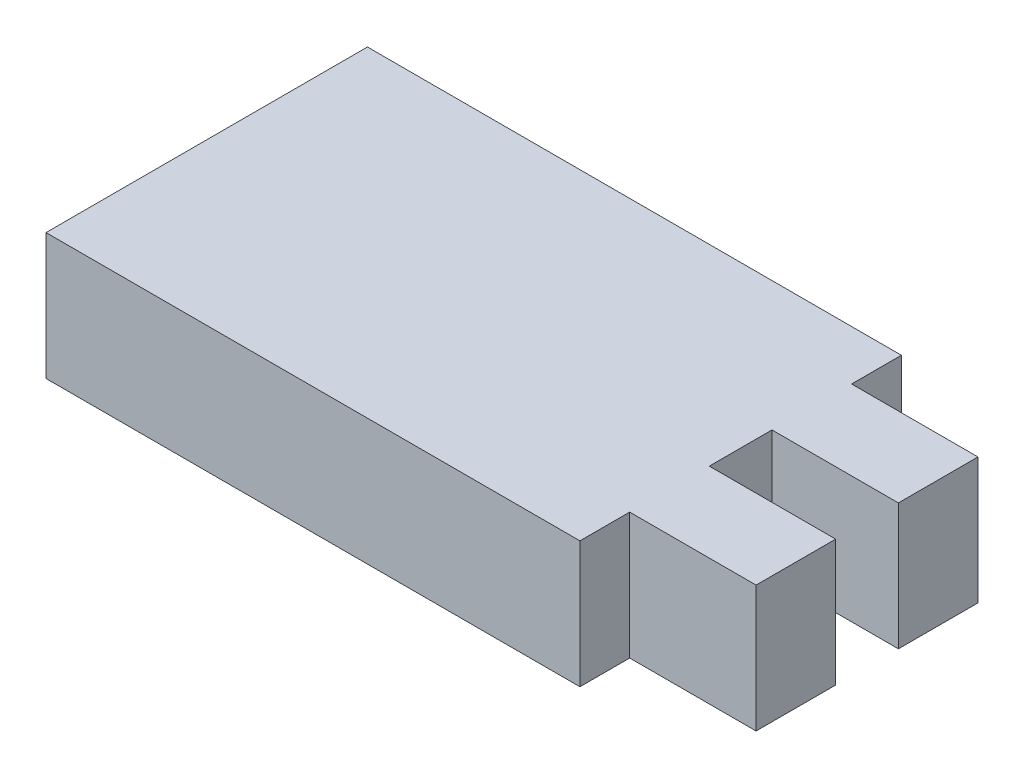
ISO-10303-21;
HEADER;
FILE_DESCRIPTION(('STEP AP214'),'2;1');
FILE_NAME('part.step','',(''),(''),'','','');
FILE_SCHEMA(('AUTOMOTIVE_DESIGN { 1 0 10303 214 1 1 1 1 }'));
ENDSEC;
DATA;
#1=APPLICATION_CONTEXT('core data for automotive mechanical design processes');
#2=APPLICATION_PROTOCOL_DEFINITION('international standard','automotive_design',2000,#1);
#3=PRODUCT_CONTEXT('',#1,'mechanical');
#4=PRODUCT('Part','Part','',(#3));
#5=PRODUCT_RELATED_PRODUCT_CATEGORY('part','',(#4));
#6=PRODUCT_DEFINITION_FORMATION('','',#4);
#7=PRODUCT_DEFINITION_CONTEXT('part definition',#1,'design');
#8=PRODUCT_DEFINITION('design','',#6,#7);
#9=PRODUCT_DEFINITION_SHAPE('','',#8);
#10=(LENGTH_UNIT() NAMED_UNIT(*) SI_UNIT(.MILLI.,.METRE.));
#11=(NAMED_UNIT(*) PLANE_ANGLE_UNIT() SI_UNIT($,.RADIAN.));
#12=(NAMED_UNIT(*) SI_UNIT($,.STERADIAN.) SOLID_ANGLE_UNIT());
#13=UNCERTAINTY_MEASURE_WITH_UNIT(LENGTH_MEASURE(1.E-05),#10,'distance_accuracy_value','');
#14=(GEOMETRIC_REPRESENTATION_CONTEXT(3) GLOBAL_UNCERTAINTY_ASSIGNED_CONTEXT((#13)) GLOBAL_UNIT_ASSIGNED_CONTEXT((#10,
#11,#12)) REPRESENTATION_CONTEXT('',''));
#15=CARTESIAN_POINT('',(0.,0.,0.));
#16=DIRECTION('',(0.,0.,1.));
#17=DIRECTION('',(1.,0.,0.));
#18=AXIS2_PLACEMENT_3D('',#15,#16,#17);
#19=CARTESIAN_POINT('',(-16.5875,6.35,-8.075));
#20=DIRECTION('',(0.,0.,1.));
#21=DIRECTION('',(1.,0.,0.));
#22=AXIS2_PLACEMENT_3D('',#19,#20,#21);
#23=PLANE('',#22);
#24=DIRECTION('',(-1.,0.,0.));
#25=VECTOR('',#24,1.);
#26=CARTESIAN_POINT('',(-16.5875,0.,-8.075));
#27=LINE('',#26,#25);
#28=CARTESIAN_POINT('',(10.2375,0.,-8.075));
#29=VERTEX_POINT('',#28);
#30=CARTESIAN_POINT('',(-16.5875,0.,-8.075));
#31=VERTEX_POINT('',#30);
#32=EDGE_CURVE('E168',#29,#31,#27,.T.);
#33=ORIENTED_EDGE('',*,*,#32,.T.);
#34=DIRECTION('',(0.,-1.,0.));
#35=VECTOR('',#34,1.);
#36=CARTESIAN_POINT('',(-16.5875,6.35,-8.075));
#37=LINE('',#36,#35);
#38=CARTESIAN_POINT('',(-16.5875,6.35,-8.075));
#39=VERTEX_POINT('',#38);
#40=EDGE_CURVE('E11',#39,#31,#37,.T.);
#41=ORIENTED_EDGE('',*,*,#40,.F.);
#42=DIRECTION('',(-1.,0.,0.));
#43=VECTOR('',#42,1.);
#44=CARTESIAN_POINT('',(-16.5875,6.35,-8.075));
#45=LINE('',#44,#43);
#46=CARTESIAN_POINT('',(10.2375,6.35,-8.075));
#47=VERTEX_POINT('',#46);
#48=EDGE_CURVE('E202',#47,#39,#45,.T.);
#49=ORIENTED_EDGE('',*,*,#48,.F.);
#50=DIRECTION('',(0.,-1.,0.));
#51=VECTOR('',#50,1.);
#52=CARTESIAN_POINT('',(10.2375,6.35,-8.075));
#53=LINE('',#52,#51);
#54=EDGE_CURVE('E164',#47,#29,#53,.T.);
#55=ORIENTED_EDGE('',*,*,#54,.T.);
#56=EDGE_LOOP('',(#33,#41,#49,#55));
#57=FACE_BOUND('',#56,.T.);
#58=ADVANCED_FACE('F43',(#57),#23,.F.);
#59=CARTESIAN_POINT('',(-16.5875,6.35,-8.075));
#60=DIRECTION('',(1.,0.,0.));
#61=DIRECTION('',(0.,0.,-1.));
#62=AXIS2_PLACEMENT_3D('',#59,#60,#61);
#63=PLANE('',#62);
#64=DIRECTION('',(0.,0.,1.));
#65=VECTOR('',#64,1.);
#66=CARTESIAN_POINT('',(-16.5875,0.,-8.075));
#67=LINE('',#66,#65);
#68=CARTESIAN_POINT('',(-16.5875,0.,8.075));
#69=VERTEX_POINT('',#68);
#70=EDGE_CURVE('E172',#31,#69,#67,.T.);
#71=ORIENTED_EDGE('',*,*,#70,.T.);
#72=DIRECTION('',(0.,-1.,0.));
#73=VECTOR('',#72,1.);
#74=CARTESIAN_POINT('',(-16.5875,6.35,8.075));
#75=LINE('',#74,#73);
#76=CARTESIAN_POINT('',(-16.5875,6.35,8.075));
#77=VERTEX_POINT('',#76);
#78=EDGE_CURVE('E52',#77,#69,#75,.T.);
#79=ORIENTED_EDGE('',*,*,#78,.F.);
#80=DIRECTION('',(0.,0.,1.));
#81=VECTOR('',#80,1.);
#82=CARTESIAN_POINT('',(-16.5875,6.35,-8.075));
#83=LINE('',#82,#81);
#84=EDGE_CURVE('E115',#39,#77,#83,.T.);
#85=ORIENTED_EDGE('',*,*,#84,.F.);
#86=ORIENTED_EDGE('',*,*,#40,.T.);
#87=EDGE_LOOP('',(#71,#79,#85,#86));
#88=FACE_BOUND('',#87,.T.);
#89=ADVANCED_FACE('F296',(#88),#63,.F.);
#90=CARTESIAN_POINT('',(-16.5875,6.35,8.075));
#91=DIRECTION('',(0.,0.,-1.));
#92=DIRECTION('',(-1.,0.,0.));
#93=AXIS2_PLACEMENT_3D('',#90,#91,#92);
#94=PLANE('',#93);
#95=DIRECTION('',(1.,0.,0.));
#96=VECTOR('',#95,1.);
#97=CARTESIAN_POINT('',(-16.5875,0.,8.075));
#98=LINE('',#97,#96);
#99=CARTESIAN_POINT('',(10.2375,0.,8.075));
#100=VERTEX_POINT('',#99);
#101=EDGE_CURVE('E175',#69,#100,#98,.T.);
#102=ORIENTED_EDGE('',*,*,#101,.T.);
#103=DIRECTION('',(0.,-1.,0.));
#104=VECTOR('',#103,1.);
#105=CARTESIAN_POINT('',(10.2375,6.35,8.075));
#106=LINE('',#105,#104);
#107=CARTESIAN_POINT('',(10.2375,6.35,8.075));
#108=VERTEX_POINT('',#107);
#109=EDGE_CURVE('E229',#108,#100,#106,.T.);
#110=ORIENTED_EDGE('',*,*,#109,.F.);
#111=DIRECTION('',(1.,0.,0.));
#112=VECTOR('',#111,1.);
#113=CARTESIAN_POINT('',(-16.5875,6.35,8.075));
#114=LINE('',#113,#112);
#115=EDGE_CURVE('E239',#77,#108,#114,.T.);
#116=ORIENTED_EDGE('',*,*,#115,.F.);
#117=ORIENTED_EDGE('',*,*,#78,.T.);
#118=EDGE_LOOP('',(#102,#110,#116,#117));
#119=FACE_BOUND('',#118,.T.);
#120=ADVANCED_FACE('F237',(#119),#94,.F.);
#121=CARTESIAN_POINT('',(10.2375,6.35,8.075));
#122=DIRECTION('',(-1.,0.,0.));
#123=DIRECTION('',(0.,0.,1.));
#124=AXIS2_PLACEMENT_3D('',#121,#122,#123);
#125=PLANE('',#124);
#126=DIRECTION('',(0.,0.,-1.));
#127=VECTOR('',#126,1.);
#128=CARTESIAN_POINT('',(10.2375,0.,8.075));
#129=LINE('',#128,#127);
#130=CARTESIAN_POINT('',(10.2375,0.,5.575));
#131=VERTEX_POINT('',#130);
#132=EDGE_CURVE('E178',#100,#131,#129,.T.);
#133=ORIENTED_EDGE('',*,*,#132,.T.);
#134=DIRECTION('',(0.,-1.,0.));
#135=VECTOR('',#134,1.);
#136=CARTESIAN_POINT('',(10.2375,6.35,5.575));
#137=LINE('',#136,#135);
#138=CARTESIAN_POINT('',(10.2375,6.35,5.575));
#139=VERTEX_POINT('',#138);
#140=EDGE_CURVE('E225',#139,#131,#137,.T.);
#141=ORIENTED_EDGE('',*,*,#140,.F.);
#142=DIRECTION('',(0.,0.,-1.));
#143=VECTOR('',#142,1.);
#144=CARTESIAN_POINT('',(10.2375,6.35,8.075));
#145=LINE('',#144,#143);
#146=EDGE_CURVE('E258',#108,#139,#145,.T.);
#147=ORIENTED_EDGE('',*,*,#146,.F.);
#148=ORIENTED_EDGE('',*,*,#109,.T.);
#149=EDGE_LOOP('',(#133,#141,#147,#148));
#150=FACE_BOUND('',#149,.T.);
#151=ADVANCED_FACE('F248',(#150),#125,.F.);
#152=CARTESIAN_POINT('',(10.2375,6.35,5.575));
#153=DIRECTION('',(0.,0.,-1.));
#154=DIRECTION('',(-1.,0.,0.));
#155=AXIS2_PLACEMENT_3D('',#152,#153,#154);
#156=PLANE('',#155);
#157=DIRECTION('',(1.,0.,0.));
#158=VECTOR('',#157,1.);
#159=CARTESIAN_POINT('',(10.2375,0.,5.575));
#160=LINE('',#159,#158);
#161=CARTESIAN_POINT('',(16.5875,0.,5.575));
#162=VERTEX_POINT('',#161);
#163=EDGE_CURVE('E181',#131,#162,#160,.T.);
#164=ORIENTED_EDGE('',*,*,#163,.T.);
#165=DIRECTION('',(0.,-1.,0.));
#166=VECTOR('',#165,1.);
#167=CARTESIAN_POINT('',(16.5875,6.35,5.575));
#168=LINE('',#167,#166);
#169=CARTESIAN_POINT('',(16.5875,6.35,5.575));
#170=VERTEX_POINT('',#169);
#171=EDGE_CURVE('E221',#170,#162,#168,.T.);
#172=ORIENTED_EDGE('',*,*,#171,.F.);
#173=DIRECTION('',(1.,0.,0.));
#174=VECTOR('',#173,1.);
#175=CARTESIAN_POINT('',(10.2375,6.35,5.575));
#176=LINE('',#175,#174);
#177=EDGE_CURVE('E254',#139,#170,#176,.T.);
#178=ORIENTED_EDGE('',*,*,#177,.F.);
#179=ORIENTED_EDGE('',*,*,#140,.T.);
#180=EDGE_LOOP('',(#164,#172,#178,#179));
#181=FACE_BOUND('',#180,.T.);
#182=ADVANCED_FACE('F252',(#181),#156,.F.);
#183=CARTESIAN_POINT('',(16.5875,6.35,5.575));
#184=DIRECTION('',(-1.,0.,0.));
#185=DIRECTION('',(0.,0.,1.));
#186=AXIS2_PLACEMENT_3D('',#183,#184,#185);
#187=PLANE('',#186);
#188=DIRECTION('',(0.,0.,-1.));
#189=VECTOR('',#188,1.);
#190=CARTESIAN_POINT('',(16.5875,0.,5.575));
#191=LINE('',#190,#189);
#192=CARTESIAN_POINT('',(16.5875,0.,1.575));
#193=VERTEX_POINT('',#192);
#194=EDGE_CURVE('E184',#162,#193,#191,.T.);
#195=ORIENTED_EDGE('',*,*,#194,.T.);
#196=DIRECTION('',(0.,-1.,0.));
#197=VECTOR('',#196,1.);
#198=CARTESIAN_POINT('',(16.5875,6.35,1.575));
#199=LINE('',#198,#197);
#200=CARTESIAN_POINT('',(16.5875,6.35,1.575));
#201=VERTEX_POINT('',#200);
#202=EDGE_CURVE('E217',#201,#193,#199,.T.);
#203=ORIENTED_EDGE('',*,*,#202,.F.);
#204=DIRECTION('',(0.,0.,-1.));
#205=VECTOR('',#204,1.);
#206=CARTESIAN_POINT('',(16.5875,6.35,5.575));
#207=LINE('',#206,#205);
#208=EDGE_CURVE('E257',#170,#201,#207,.T.);
#209=ORIENTED_EDGE('',*,*,#208,.F.);
#210=ORIENTED_EDGE('',*,*,#171,.T.);
#211=EDGE_LOOP('',(#195,#203,#209,#210));
#212=FACE_BOUND('',#211,.T.);
#213=ADVANCED_FACE('F309',(#212),#187,.F.);
#214=CARTESIAN_POINT('',(16.5875,6.35,1.575));
#215=DIRECTION('',(0.,0.,1.));
#216=DIRECTION('',(1.,0.,0.));
#217=AXIS2_PLACEMENT_3D('',#214,#215,#216);
#218=PLANE('',#217);
#219=DIRECTION('',(-1.,0.,0.));
#220=VECTOR('',#219,1.);
#221=CARTESIAN_POINT('',(16.5875,0.,1.575));
#222=LINE('',#221,#220);
#223=CARTESIAN_POINT('',(10.2375,0.,1.575));
#224=VERTEX_POINT('',#223);
#225=EDGE_CURVE('E187',#193,#224,#222,.T.);
#226=ORIENTED_EDGE('',*,*,#225,.T.);
#227=DIRECTION('',(0.,-1.,0.));
#228=VECTOR('',#227,1.);
#229=CARTESIAN_POINT('',(10.2375,6.35,1.575));
#230=LINE('',#229,#228);
#231=CARTESIAN_POINT('',(10.2375,6.35,1.575));
#232=VERTEX_POINT('',#231);
#233=EDGE_CURVE('E213',#232,#224,#230,.T.);
#234=ORIENTED_EDGE('',*,*,#233,.F.);
#235=DIRECTION('',(-1.,0.,0.));
#236=VECTOR('',#235,1.);
#237=CARTESIAN_POINT('',(16.5875,6.35,1.575));
#238=LINE('',#237,#236);
#239=EDGE_CURVE('E262',#201,#232,#238,.T.);
#240=ORIENTED_EDGE('',*,*,#239,.F.);
#241=ORIENTED_EDGE('',*,*,#202,.T.);
#242=EDGE_LOOP('',(#226,#234,#240,#241));
#243=FACE_BOUND('',#242,.T.);
#244=ADVANCED_FACE('F312',(#243),#218,.F.);
#245=CARTESIAN_POINT('',(10.2375,6.35,1.575));
#246=DIRECTION('',(-1.,0.,0.));
#247=DIRECTION('',(0.,0.,1.));
#248=AXIS2_PLACEMENT_3D('',#245,#246,#247);
#249=PLANE('',#248);
#250=DIRECTION('',(0.,0.,-1.));
#251=VECTOR('',#250,1.);
#252=CARTESIAN_POINT('',(10.2375,0.,1.575));
#253=LINE('',#252,#251);
#254=CARTESIAN_POINT('',(10.2375,0.,-1.575));
#255=VERTEX_POINT('',#254);
#256=EDGE_CURVE('E190',#224,#255,#253,.T.);
#257=ORIENTED_EDGE('',*,*,#256,.T.);
#258=DIRECTION('',(0.,-1.,0.));
#259=VECTOR('',#258,1.);
#260=CARTESIAN_POINT('',(10.2375,6.35,-1.575));
#261=LINE('',#260,#259);
#262=CARTESIAN_POINT('',(10.2375,6.35,-1.575));
#263=VERTEX_POINT('',#262);
#264=EDGE_CURVE('E209',#263,#255,#261,.T.);
#265=ORIENTED_EDGE('',*,*,#264,.F.);
#266=DIRECTION('',(0.,0.,-1.));
#267=VECTOR('',#266,1.);
#268=CARTESIAN_POINT('',(10.2375,6.35,1.575));
#269=LINE('',#268,#267);
#270=EDGE_CURVE('E269',#232,#263,#269,.T.);
#271=ORIENTED_EDGE('',*,*,#270,.F.);
#272=ORIENTED_EDGE('',*,*,#233,.T.);
#273=EDGE_LOOP('',(#257,#265,#271,#272));
#274=FACE_BOUND('',#273,.T.);
#275=ADVANCED_FACE('F277',(#274),#249,.F.);
#276=CARTESIAN_POINT('',(16.5875,6.35,-1.575));
#277=DIRECTION('',(0.,0.,-1.));
#278=DIRECTION('',(-1.,0.,0.));
#279=AXIS2_PLACEMENT_3D('',#276,#277,#278);
#280=PLANE('',#279);
#281=DIRECTION('',(1.,0.,0.));
#282=VECTOR('',#281,1.);
#283=CARTESIAN_POINT('',(16.5875,0.,-1.575));
#284=LINE('',#283,#282);
#285=CARTESIAN_POINT('',(16.5875,0.,-1.575));
#286=VERTEX_POINT('',#285);
#287=EDGE_CURVE('E193',#255,#286,#284,.T.);
#288=ORIENTED_EDGE('',*,*,#287,.T.);
#289=DIRECTION('',(0.,-1.,0.));
#290=VECTOR('',#289,1.);
#291=CARTESIAN_POINT('',(16.5875,6.35,-1.575));
#292=LINE('',#291,#290);
#293=CARTESIAN_POINT('',(16.5875,6.35,-1.575));
#294=VERTEX_POINT('',#293);
#295=EDGE_CURVE('E157',#294,#286,#292,.T.);
#296=ORIENTED_EDGE('',*,*,#295,.F.);
#297=DIRECTION('',(1.,0.,0.));
#298=VECTOR('',#297,1.);
#299=CARTESIAN_POINT('',(16.5875,6.35,-1.575));
#300=LINE('',#299,#298);
#301=EDGE_CURVE('E146',#263,#294,#300,.T.);
#302=ORIENTED_EDGE('',*,*,#301,.F.);
#303=ORIENTED_EDGE('',*,*,#264,.T.);
#304=EDGE_LOOP('',(#288,#296,#302,#303));
#305=FACE_BOUND('',#304,.T.);
#306=ADVANCED_FACE('F281',(#305),#280,.F.);
#307=CARTESIAN_POINT('',(16.5875,6.35,-5.575));
#308=DIRECTION('',(-1.,0.,0.));
#309=DIRECTION('',(0.,0.,1.));
#310=AXIS2_PLACEMENT_3D('',#307,#308,#309);
#311=PLANE('',#310);
#312=DIRECTION('',(0.,0.,-1.));
#313=VECTOR('',#312,1.);
#314=CARTESIAN_POINT('',(16.5875,0.,-5.575));
#315=LINE('',#314,#313);
#316=CARTESIAN_POINT('',(16.5875,0.,-5.575));
#317=VERTEX_POINT('',#316);
#318=EDGE_CURVE('E155',#286,#317,#315,.T.);
#319=ORIENTED_EDGE('',*,*,#318,.T.);
#320=DIRECTION('',(0.,-1.,0.));
#321=VECTOR('',#320,1.);
#322=CARTESIAN_POINT('',(16.5875,6.35,-5.575));
#323=LINE('',#322,#321);
#324=CARTESIAN_POINT('',(16.5875,6.35,-5.575));
#325=VERTEX_POINT('',#324);
#326=EDGE_CURVE('E152',#325,#317,#323,.T.);
#327=ORIENTED_EDGE('',*,*,#326,.F.);
#328=DIRECTION('',(0.,0.,-1.));
#329=VECTOR('',#328,1.);
#330=CARTESIAN_POINT('',(16.5875,6.35,-5.575));
#331=LINE('',#330,#329);
#332=EDGE_CURVE('E140',#294,#325,#331,.T.);
#333=ORIENTED_EDGE('',*,*,#332,.F.);
#334=ORIENTED_EDGE('',*,*,#295,.T.);
#335=EDGE_LOOP('',(#319,#327,#333,#334));
#336=FACE_BOUND('',#335,.T.);
#337=ADVANCED_FACE('F153',(#336),#311,.F.);
#338=CARTESIAN_POINT('',(16.5875,6.35,-5.575));
#339=DIRECTION('',(0.,0.,1.));
#340=DIRECTION('',(1.,0.,0.));
#341=AXIS2_PLACEMENT_3D('',#338,#339,#340);
#342=PLANE('',#341);
#343=DIRECTION('',(-1.,0.,0.));
#344=VECTOR('',#343,1.);
#345=CARTESIAN_POINT('',(16.5875,0.,-5.575));
#346=LINE('',#345,#344);
#347=CARTESIAN_POINT('',(10.2375,0.,-5.575));
#348=VERTEX_POINT('',#347);
#349=EDGE_CURVE('E101',#317,#348,#346,.T.);
#350=ORIENTED_EDGE('',*,*,#349,.T.);
#351=DIRECTION('',(0.,-1.,0.));
#352=VECTOR('',#351,1.);
#353=CARTESIAN_POINT('',(10.2375,6.35,-5.575));
#354=LINE('',#353,#352);
#355=CARTESIAN_POINT('',(10.2375,6.35,-5.575));
#356=VERTEX_POINT('',#355);
#357=EDGE_CURVE('E158',#356,#348,#354,.T.);
#358=ORIENTED_EDGE('',*,*,#357,.F.);
#359=DIRECTION('',(-1.,0.,0.));
#360=VECTOR('',#359,1.);
#361=CARTESIAN_POINT('',(16.5875,6.35,-5.575));
#362=LINE('',#361,#360);
#363=EDGE_CURVE('E144',#325,#356,#362,.T.);
#364=ORIENTED_EDGE('',*,*,#363,.F.);
#365=ORIENTED_EDGE('',*,*,#326,.T.);
#366=EDGE_LOOP('',(#350,#358,#364,#365));
#367=FACE_BOUND('',#366,.T.);
#368=ADVANCED_FACE('F160',(#367),#342,.F.);
#369=CARTESIAN_POINT('',(10.2375,6.35,-5.575));
#370=DIRECTION('',(-1.,0.,0.));
#371=DIRECTION('',(0.,0.,1.));
#372=AXIS2_PLACEMENT_3D('',#369,#370,#371);
#373=PLANE('',#372);
#374=DIRECTION('',(0.,0.,-1.));
#375=VECTOR('',#374,1.);
#376=CARTESIAN_POINT('',(10.2375,0.,-5.575));
#377=LINE('',#376,#375);
#378=EDGE_CURVE('E107',#348,#29,#377,.T.);
#379=ORIENTED_EDGE('',*,*,#378,.T.);
#380=ORIENTED_EDGE('',*,*,#54,.F.);
#381=DIRECTION('',(0.,0.,-1.));
#382=VECTOR('',#381,1.);
#383=CARTESIAN_POINT('',(10.2375,6.35,-5.575));
#384=LINE('',#383,#382);
#385=EDGE_CURVE('E60',#356,#47,#384,.T.);
#386=ORIENTED_EDGE('',*,*,#385,.F.);
#387=ORIENTED_EDGE('',*,*,#357,.T.);
#388=EDGE_LOOP('',(#379,#380,#386,#387));
#389=FACE_BOUND('',#388,.T.);
#390=ADVANCED_FACE('F285',(#389),#373,.F.);
#391=CARTESIAN_POINT('',(0.,6.35,0.));
#392=DIRECTION('',(0.,1.,0.));
#393=DIRECTION('',(0.,0.,1.));
#394=AXIS2_PLACEMENT_3D('',#391,#392,#393);
#395=PLANE('',#394);
#396=ORIENTED_EDGE('',*,*,#48,.T.);
#397=ORIENTED_EDGE('',*,*,#84,.T.);
#398=ORIENTED_EDGE('',*,*,#115,.T.);
#399=ORIENTED_EDGE('',*,*,#146,.T.);
#400=ORIENTED_EDGE('',*,*,#177,.T.);
#401=ORIENTED_EDGE('',*,*,#208,.T.);
#402=ORIENTED_EDGE('',*,*,#239,.T.);
#403=ORIENTED_EDGE('',*,*,#270,.T.);
#404=ORIENTED_EDGE('',*,*,#301,.T.);
#405=ORIENTED_EDGE('',*,*,#332,.T.);
#406=ORIENTED_EDGE('',*,*,#363,.T.);
#407=ORIENTED_EDGE('',*,*,#385,.T.);
#408=EDGE_LOOP('',(#396,#397,#398,#399,#400,#401,#402,#403,#404,#405,#406,#407));
#409=FACE_BOUND('',#408,.T.);
#410=ADVANCED_FACE('F142',(#409),#395,.T.);
#411=CARTESIAN_POINT('',(0.,0.,0.));
#412=DIRECTION('',(0.,1.,0.));
#413=DIRECTION('',(0.,0.,1.));
#414=AXIS2_PLACEMENT_3D('',#411,#412,#413);
#415=PLANE('',#414);
#416=ORIENTED_EDGE('',*,*,#32,.F.);
#417=ORIENTED_EDGE('',*,*,#378,.F.);
#418=ORIENTED_EDGE('',*,*,#349,.F.);
#419=ORIENTED_EDGE('',*,*,#318,.F.);
#420=ORIENTED_EDGE('',*,*,#287,.F.);
#421=ORIENTED_EDGE('',*,*,#256,.F.);
#422=ORIENTED_EDGE('',*,*,#225,.F.);
#423=ORIENTED_EDGE('',*,*,#194,.F.);
#424=ORIENTED_EDGE('',*,*,#163,.F.);
#425=ORIENTED_EDGE('',*,*,#132,.F.);
#426=ORIENTED_EDGE('',*,*,#101,.F.);
#427=ORIENTED_EDGE('',*,*,#70,.F.);
#428=EDGE_LOOP('',(#416,#417,#418,#419,#420,#421,#422,#423,#424,#425,#426,#427));
#429=FACE_BOUND('',#428,.T.);
#430=ADVANCED_FACE('F243',(#429),#415,.F.);
#431=CLOSED_SHELL('',(#58,#89,#120,#151,#182,#213,#244,#275,#306,#337,#368,#390,#410,#430));
#432=MANIFOLD_SOLID_BREP('B2',#431);
#433=ADVANCED_BREP_SHAPE_REPRESENTATION('',(#18,#432),#14);
#434=SHAPE_DEFINITION_REPRESENTATION(#9,#433);
ENDSEC;
END-ISO-10303-21;
